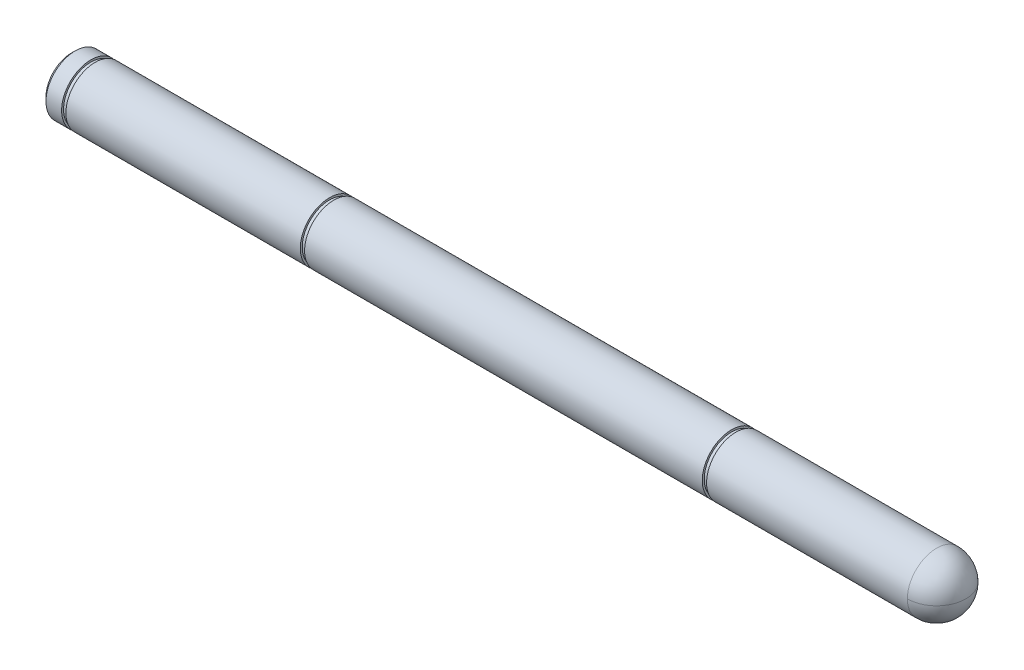
ISO-10303-21;
HEADER;
FILE_DESCRIPTION(('STEP AP214'),'2;1');
FILE_NAME('part.step','',(''),(''),'','','');
FILE_SCHEMA(('AUTOMOTIVE_DESIGN { 1 0 10303 214 1 1 1 1 }'));
ENDSEC;
DATA;
#1=APPLICATION_CONTEXT('core data for automotive mechanical design processes');
#2=APPLICATION_PROTOCOL_DEFINITION('international standard','automotive_design',2000,#1);
#3=PRODUCT_CONTEXT('',#1,'mechanical');
#4=PRODUCT('Part','Part','',(#3));
#5=PRODUCT_RELATED_PRODUCT_CATEGORY('part','',(#4));
#6=PRODUCT_DEFINITION_FORMATION('','',#4);
#7=PRODUCT_DEFINITION_CONTEXT('part definition',#1,'design');
#8=PRODUCT_DEFINITION('design','',#6,#7);
#9=PRODUCT_DEFINITION_SHAPE('','',#8);
#10=(LENGTH_UNIT() NAMED_UNIT(*) SI_UNIT(.MILLI.,.METRE.));
#11=(NAMED_UNIT(*) PLANE_ANGLE_UNIT() SI_UNIT($,.RADIAN.));
#12=(NAMED_UNIT(*) SI_UNIT($,.STERADIAN.) SOLID_ANGLE_UNIT());
#13=UNCERTAINTY_MEASURE_WITH_UNIT(LENGTH_MEASURE(1.E-05),#10,'distance_accuracy_value','');
#14=(GEOMETRIC_REPRESENTATION_CONTEXT(3) GLOBAL_UNCERTAINTY_ASSIGNED_CONTEXT((#13)) GLOBAL_UNIT_ASSIGNED_CONTEXT((#10,
#11,#12)) REPRESENTATION_CONTEXT('',''));
#15=CARTESIAN_POINT('',(0.,0.,0.));
#16=DIRECTION('',(0.,0.,1.));
#17=DIRECTION('',(1.,0.,0.));
#18=AXIS2_PLACEMENT_3D('',#15,#16,#17);
#19=CARTESIAN_POINT('',(-128.998653108,0.,0.));
#20=DIRECTION('',(1.,0.,0.));
#21=DIRECTION('',(0.,0.,-1.));
#22=AXIS2_PLACEMENT_3D('',#19,#20,#21);
#23=PLANE('',#22);
#24=CARTESIAN_POINT('',(-128.998653108,0.,-1.11022302462516E-13));
#25=DIRECTION('',(1.,0.,0.));
#26=DIRECTION('',(0.,0.,-1.));
#27=AXIS2_PLACEMENT_3D('',#24,#25,#26);
#28=CIRCLE('',#27,6.49980307283878);
#29=CARTESIAN_POINT('',(-128.998653108,0.,-6.49980307283889));
#30=VERTEX_POINT('',#29);
#31=EDGE_CURVE('E19',#30,#30,#28,.T.);
#32=ORIENTED_EDGE('',*,*,#31,.F.);
#33=EDGE_LOOP('',(#32));
#34=FACE_BOUND('',#33,.T.);
#35=ADVANCED_FACE('F16',(#34),#23,.F.);
#36=CARTESIAN_POINT('',(-127.998539496161,0.,-1.11022302462516E-13));
#37=DIRECTION('',(1.,0.,0.));
#38=DIRECTION('',(0.,0.,-1.));
#39=AXIS2_PLACEMENT_3D('',#36,#37,#38);
#40=CONICAL_SURFACE('',#39,7.49988638483501,0.785383014967778);
#41=CARTESIAN_POINT('',(-127.998425877554,0.,-1.11022302462516E-13));
#42=DIRECTION('',(1.,0.,0.));
#43=DIRECTION('',(0.,0.,-1.));
#44=AXIS2_PLACEMENT_3D('',#41,#42,#43);
#45=CIRCLE('',#44,7.5);
#46=CARTESIAN_POINT('',(-127.998425877554,0.,-7.50000000000011));
#47=VERTEX_POINT('',#46);
#48=EDGE_CURVE('E67',#47,#47,#45,.T.);
#49=ORIENTED_EDGE('',*,*,#48,.F.);
#50=EDGE_LOOP('',(#49));
#51=FACE_BOUND('',#50,.T.);
#52=ORIENTED_EDGE('',*,*,#31,.T.);
#53=EDGE_LOOP('',(#52));
#54=FACE_BOUND('',#53,.T.);
#55=ADVANCED_FACE('F74',(#51,#54),#40,.T.);
#56=CARTESIAN_POINT('',(-383.381670343,0.,0.));
#57=DIRECTION('',(1.,0.,0.));
#58=DIRECTION('',(0.,0.,-1.));
#59=AXIS2_PLACEMENT_3D('',#56,#57,#58);
#60=CYLINDRICAL_SURFACE('',#59,7.5);
#61=CARTESIAN_POINT('',(-123.998653108,2.22044604925031E-13,0.));
#62=DIRECTION('',(1.,0.,0.));
#63=DIRECTION('',(0.,0.,-1.));
#64=AXIS2_PLACEMENT_3D('',#61,#62,#63);
#65=CIRCLE('',#64,7.5);
#66=CARTESIAN_POINT('',(-123.998653108,2.22044604925031E-13,-7.5));
#67=VERTEX_POINT('',#66);
#68=EDGE_CURVE('E65',#67,#67,#65,.T.);
#69=ORIENTED_EDGE('',*,*,#68,.F.);
#70=EDGE_LOOP('',(#69));
#71=FACE_BOUND('',#70,.T.);
#72=ORIENTED_EDGE('',*,*,#48,.T.);
#73=EDGE_LOOP('',(#72));
#74=FACE_BOUND('',#73,.T.);
#75=ADVANCED_FACE('F81',(#71,#74),#60,.T.);
#76=CARTESIAN_POINT('',(-123.998653108,2.22044604925031E-13,0.));
#77=DIRECTION('',(1.,0.,0.));
#78=DIRECTION('',(0.,0.,-1.));
#79=AXIS2_PLACEMENT_3D('',#76,#77,#78);
#80=PLANE('',#79);
#81=CARTESIAN_POINT('',(-123.998653108,2.22044604925031E-13,0.));
#82=DIRECTION('',(1.,0.,0.));
#83=DIRECTION('',(0.,0.,-1.));
#84=AXIS2_PLACEMENT_3D('',#81,#82,#83);
#85=CIRCLE('',#84,7.);
#86=CARTESIAN_POINT('',(-123.998653108,2.22044604925031E-13,-7.));
#87=VERTEX_POINT('',#86);
#88=EDGE_CURVE('E47',#87,#87,#85,.T.);
#89=ORIENTED_EDGE('',*,*,#88,.F.);
#90=EDGE_LOOP('',(#89));
#91=FACE_BOUND('',#90,.T.);
#92=ORIENTED_EDGE('',*,*,#68,.T.);
#93=EDGE_LOOP('',(#92));
#94=FACE_BOUND('',#93,.T.);
#95=ADVANCED_FACE('F178',(#91,#94),#80,.T.);
#96=CARTESIAN_POINT('',(-383.381670343,0.,0.));
#97=DIRECTION('',(1.,0.,0.));
#98=DIRECTION('',(0.,0.,-1.));
#99=AXIS2_PLACEMENT_3D('',#96,#97,#98);
#100=CYLINDRICAL_SURFACE('',#99,7.);
#101=CARTESIAN_POINT('',(-122.898653108,2.22044604925031E-13,0.));
#102=DIRECTION('',(1.,0.,0.));
#103=DIRECTION('',(0.,0.,-1.));
#104=AXIS2_PLACEMENT_3D('',#101,#102,#103);
#105=CIRCLE('',#104,7.);
#106=CARTESIAN_POINT('',(-122.898653108,2.22044604925031E-13,-7.));
#107=VERTEX_POINT('',#106);
#108=EDGE_CURVE('E46',#107,#107,#105,.F.);
#109=ORIENTED_EDGE('',*,*,#108,.T.);
#110=EDGE_LOOP('',(#109));
#111=FACE_BOUND('',#110,.T.);
#112=ORIENTED_EDGE('',*,*,#88,.T.);
#113=EDGE_LOOP('',(#112));
#114=FACE_BOUND('',#113,.T.);
#115=ADVANCED_FACE('F175',(#111,#114),#100,.T.);
#116=CARTESIAN_POINT('',(92.5013468917,0.,0.));
#117=DIRECTION('',(0.,-1.,0.));
#118=DIRECTION('',(0.,0.,-1.));
#119=AXIS2_PLACEMENT_3D('',#116,#117,#118);
#120=SPHERICAL_SURFACE('',#119,7.5);
#121=CARTESIAN_POINT('',(92.5013468917,0.,0.));
#122=DIRECTION('',(1.,0.,0.));
#123=DIRECTION('',(0.,0.,-1.));
#124=AXIS2_PLACEMENT_3D('',#121,#122,#123);
#125=CIRCLE('',#124,7.5);
#126=CARTESIAN_POINT('',(92.5013468917,0.,7.50000000000001));
#127=VERTEX_POINT('',#126);
#128=CARTESIAN_POINT('',(92.5013468917,7.50000000000001,0.));
#129=VERTEX_POINT('',#128);
#130=EDGE_CURVE('E44',#127,#129,#125,.F.);
#131=ORIENTED_EDGE('',*,*,#130,.F.);
#132=CARTESIAN_POINT('',(92.5013468917,0.,0.));
#133=DIRECTION('',(0.,1.,0.));
#134=DIRECTION('',(0.,0.,1.));
#135=AXIS2_PLACEMENT_3D('',#132,#133,#134);
#136=CIRCLE('',#135,7.5);
#137=CARTESIAN_POINT('',(92.5013468917,0.,-7.50000000000001));
#138=VERTEX_POINT('',#137);
#139=EDGE_CURVE('E42',#138,#127,#136,.F.);
#140=ORIENTED_EDGE('',*,*,#139,.F.);
#141=CARTESIAN_POINT('',(92.5013468917,0.,0.));
#142=DIRECTION('',(1.,0.,0.));
#143=DIRECTION('',(0.,0.,-1.));
#144=AXIS2_PLACEMENT_3D('',#141,#142,#143);
#145=CIRCLE('',#144,7.5);
#146=EDGE_CURVE('E33',#129,#138,#145,.F.);
#147=ORIENTED_EDGE('',*,*,#146,.F.);
#148=EDGE_LOOP('',(#131,#140,#147));
#149=FACE_BOUND('',#148,.T.);
#150=ADVANCED_FACE('F43',(#149),#120,.T.);
#151=CARTESIAN_POINT('',(92.5013468917,0.,0.));
#152=DIRECTION('',(0.,1.,0.));
#153=DIRECTION('',(0.,0.,1.));
#154=AXIS2_PLACEMENT_3D('',#151,#152,#153);
#155=SPHERICAL_SURFACE('',#154,7.5);
#156=CARTESIAN_POINT('',(92.5013468917,0.,0.));
#157=DIRECTION('',(1.,0.,0.));
#158=DIRECTION('',(0.,0.,-1.));
#159=AXIS2_PLACEMENT_3D('',#156,#157,#158);
#160=CIRCLE('',#159,7.5);
#161=CARTESIAN_POINT('',(92.5013468917,-7.49999999999999,0.));
#162=VERTEX_POINT('',#161);
#163=EDGE_CURVE('E50',#138,#162,#160,.F.);
#164=ORIENTED_EDGE('',*,*,#163,.F.);
#165=ORIENTED_EDGE('',*,*,#139,.T.);
#166=CARTESIAN_POINT('',(92.5013468917,0.,0.));
#167=DIRECTION('',(1.,0.,0.));
#168=DIRECTION('',(0.,0.,-1.));
#169=AXIS2_PLACEMENT_3D('',#166,#167,#168);
#170=CIRCLE('',#169,7.5);
#171=EDGE_CURVE('E52',#162,#127,#170,.F.);
#172=ORIENTED_EDGE('',*,*,#171,.F.);
#173=EDGE_LOOP('',(#164,#165,#172));
#174=FACE_BOUND('',#173,.T.);
#175=ADVANCED_FACE('F51',(#174),#155,.T.);
#176=CARTESIAN_POINT('',(-122.898653108,2.22044604925031E-13,0.));
#177=DIRECTION('',(1.,0.,0.));
#178=DIRECTION('',(0.,0.,-1.));
#179=AXIS2_PLACEMENT_3D('',#176,#177,#178);
#180=PLANE('',#179);
#181=ORIENTED_EDGE('',*,*,#108,.F.);
#182=EDGE_LOOP('',(#181));
#183=FACE_BOUND('',#182,.T.);
#184=CARTESIAN_POINT('',(-122.898653108,2.22044604925031E-13,0.));
#185=DIRECTION('',(1.,0.,0.));
#186=DIRECTION('',(0.,0.,-1.));
#187=AXIS2_PLACEMENT_3D('',#184,#185,#186);
#188=CIRCLE('',#187,7.5);
#189=CARTESIAN_POINT('',(-122.898653108,2.22044604925031E-13,-7.5));
#190=VERTEX_POINT('',#189);
#191=EDGE_CURVE('E155',#190,#190,#188,.T.);
#192=ORIENTED_EDGE('',*,*,#191,.F.);
#193=EDGE_LOOP('',(#192));
#194=FACE_BOUND('',#193,.T.);
#195=ADVANCED_FACE('F121',(#183,#194),#180,.F.);
#196=CARTESIAN_POINT('',(-383.381670343,0.,0.));
#197=DIRECTION('',(1.,0.,0.));
#198=DIRECTION('',(0.,0.,-1.));
#199=AXIS2_PLACEMENT_3D('',#196,#197,#198);
#200=CYLINDRICAL_SURFACE('',#199,7.5);
#201=CARTESIAN_POINT('',(41.1013468917,0.,0.));
#202=DIRECTION('',(1.,0.,0.));
#203=DIRECTION('',(0.,0.,-1.));
#204=AXIS2_PLACEMENT_3D('',#201,#202,#203);
#205=CIRCLE('',#204,7.5);
#206=CARTESIAN_POINT('',(41.1013468917,0.,-7.5));
#207=VERTEX_POINT('',#206);
#208=EDGE_CURVE('E153',#207,#207,#205,.T.);
#209=ORIENTED_EDGE('',*,*,#208,.T.);
#210=EDGE_LOOP('',(#209));
#211=FACE_BOUND('',#210,.T.);
#212=ORIENTED_EDGE('',*,*,#171,.T.);
#213=ORIENTED_EDGE('',*,*,#130,.T.);
#214=ORIENTED_EDGE('',*,*,#146,.T.);
#215=ORIENTED_EDGE('',*,*,#163,.T.);
#216=EDGE_LOOP('',(#212,#213,#214,#215));
#217=FACE_BOUND('',#216,.T.);
#218=ADVANCED_FACE('F55',(#211,#217),#200,.T.);
#219=CARTESIAN_POINT('',(-383.381670343,0.,0.));
#220=DIRECTION('',(1.,0.,0.));
#221=DIRECTION('',(0.,0.,-1.));
#222=AXIS2_PLACEMENT_3D('',#219,#220,#221);
#223=CYLINDRICAL_SURFACE('',#222,7.5);
#224=ORIENTED_EDGE('',*,*,#191,.T.);
#225=EDGE_LOOP('',(#224));
#226=FACE_BOUND('',#225,.T.);
#227=CARTESIAN_POINT('',(-62.8986531083,0.,0.));
#228=DIRECTION('',(1.,0.,0.));
#229=DIRECTION('',(0.,0.,-1.));
#230=AXIS2_PLACEMENT_3D('',#227,#228,#229);
#231=CIRCLE('',#230,7.5);
#232=CARTESIAN_POINT('',(-62.8986531083,0.,-7.5));
#233=VERTEX_POINT('',#232);
#234=EDGE_CURVE('E150',#233,#233,#231,.T.);
#235=ORIENTED_EDGE('',*,*,#234,.F.);
#236=EDGE_LOOP('',(#235));
#237=FACE_BOUND('',#236,.T.);
#238=ADVANCED_FACE('F114',(#226,#237),#223,.T.);
#239=CARTESIAN_POINT('',(41.1013468917,0.,0.));
#240=DIRECTION('',(1.,0.,0.));
#241=DIRECTION('',(0.,0.,-1.));
#242=AXIS2_PLACEMENT_3D('',#239,#240,#241);
#243=PLANE('',#242);
#244=CARTESIAN_POINT('',(41.1013468917,0.,0.));
#245=DIRECTION('',(1.,0.,0.));
#246=DIRECTION('',(0.,0.,-1.));
#247=AXIS2_PLACEMENT_3D('',#244,#245,#246);
#248=CIRCLE('',#247,7.);
#249=CARTESIAN_POINT('',(41.1013468917,0.,-7.));
#250=VERTEX_POINT('',#249);
#251=EDGE_CURVE('E147',#250,#250,#248,.F.);
#252=ORIENTED_EDGE('',*,*,#251,.F.);
#253=EDGE_LOOP('',(#252));
#254=FACE_BOUND('',#253,.T.);
#255=ORIENTED_EDGE('',*,*,#208,.F.);
#256=EDGE_LOOP('',(#255));
#257=FACE_BOUND('',#256,.T.);
#258=ADVANCED_FACE('F110',(#254,#257),#243,.F.);
#259=CARTESIAN_POINT('',(-62.8986531083,0.,0.));
#260=DIRECTION('',(1.,0.,0.));
#261=DIRECTION('',(0.,0.,-1.));
#262=AXIS2_PLACEMENT_3D('',#259,#260,#261);
#263=PLANE('',#262);
#264=CARTESIAN_POINT('',(-62.8986531083,0.,0.));
#265=DIRECTION('',(1.,0.,0.));
#266=DIRECTION('',(0.,0.,-1.));
#267=AXIS2_PLACEMENT_3D('',#264,#265,#266);
#268=CIRCLE('',#267,7.);
#269=CARTESIAN_POINT('',(-62.8986531083,0.,-7.));
#270=VERTEX_POINT('',#269);
#271=EDGE_CURVE('E144',#270,#270,#268,.T.);
#272=ORIENTED_EDGE('',*,*,#271,.F.);
#273=EDGE_LOOP('',(#272));
#274=FACE_BOUND('',#273,.T.);
#275=ORIENTED_EDGE('',*,*,#234,.T.);
#276=EDGE_LOOP('',(#275));
#277=FACE_BOUND('',#276,.T.);
#278=ADVANCED_FACE('F106',(#274,#277),#263,.T.);
#279=CARTESIAN_POINT('',(-383.381670343,0.,0.));
#280=DIRECTION('',(1.,0.,0.));
#281=DIRECTION('',(0.,0.,-1.));
#282=AXIS2_PLACEMENT_3D('',#279,#280,#281);
#283=CYLINDRICAL_SURFACE('',#282,7.);
#284=ORIENTED_EDGE('',*,*,#251,.T.);
#285=EDGE_LOOP('',(#284));
#286=FACE_BOUND('',#285,.T.);
#287=CARTESIAN_POINT('',(40.0013468917,0.,0.));
#288=DIRECTION('',(1.,0.,0.));
#289=DIRECTION('',(0.,0.,-1.));
#290=AXIS2_PLACEMENT_3D('',#287,#288,#289);
#291=CIRCLE('',#290,7.);
#292=CARTESIAN_POINT('',(40.0013468917,0.,-7.));
#293=VERTEX_POINT('',#292);
#294=EDGE_CURVE('E141',#293,#293,#291,.F.);
#295=ORIENTED_EDGE('',*,*,#294,.F.);
#296=EDGE_LOOP('',(#295));
#297=FACE_BOUND('',#296,.T.);
#298=ADVANCED_FACE('F102',(#286,#297),#283,.T.);
#299=CARTESIAN_POINT('',(-383.381670343,0.,0.));
#300=DIRECTION('',(1.,0.,0.));
#301=DIRECTION('',(0.,0.,-1.));
#302=AXIS2_PLACEMENT_3D('',#299,#300,#301);
#303=CYLINDRICAL_SURFACE('',#302,7.);
#304=CARTESIAN_POINT('',(-61.7986531083,0.,0.));
#305=DIRECTION('',(1.,0.,0.));
#306=DIRECTION('',(0.,0.,-1.));
#307=AXIS2_PLACEMENT_3D('',#304,#305,#306);
#308=CIRCLE('',#307,7.);
#309=CARTESIAN_POINT('',(-61.7986531083,0.,-7.));
#310=VERTEX_POINT('',#309);
#311=EDGE_CURVE('E138',#310,#310,#308,.F.);
#312=ORIENTED_EDGE('',*,*,#311,.T.);
#313=EDGE_LOOP('',(#312));
#314=FACE_BOUND('',#313,.T.);
#315=ORIENTED_EDGE('',*,*,#271,.T.);
#316=EDGE_LOOP('',(#315));
#317=FACE_BOUND('',#316,.T.);
#318=ADVANCED_FACE('F98',(#314,#317),#303,.T.);
#319=CARTESIAN_POINT('',(40.0013468917,0.,0.));
#320=DIRECTION('',(1.,0.,0.));
#321=DIRECTION('',(0.,0.,-1.));
#322=AXIS2_PLACEMENT_3D('',#319,#320,#321);
#323=PLANE('',#322);
#324=ORIENTED_EDGE('',*,*,#294,.T.);
#325=EDGE_LOOP('',(#324));
#326=FACE_BOUND('',#325,.T.);
#327=CARTESIAN_POINT('',(40.0013468917,0.,0.));
#328=DIRECTION('',(1.,0.,0.));
#329=DIRECTION('',(0.,0.,-1.));
#330=AXIS2_PLACEMENT_3D('',#327,#328,#329);
#331=CIRCLE('',#330,7.5);
#332=CARTESIAN_POINT('',(40.0013468917,0.,-7.5));
#333=VERTEX_POINT('',#332);
#334=EDGE_CURVE('E25',#333,#333,#331,.F.);
#335=ORIENTED_EDGE('',*,*,#334,.F.);
#336=EDGE_LOOP('',(#335));
#337=FACE_BOUND('',#336,.T.);
#338=ADVANCED_FACE('F91',(#326,#337),#323,.T.);
#339=CARTESIAN_POINT('',(-61.7986531083,0.,0.));
#340=DIRECTION('',(1.,0.,0.));
#341=DIRECTION('',(0.,0.,-1.));
#342=AXIS2_PLACEMENT_3D('',#339,#340,#341);
#343=PLANE('',#342);
#344=ORIENTED_EDGE('',*,*,#311,.F.);
#345=EDGE_LOOP('',(#344));
#346=FACE_BOUND('',#345,.T.);
#347=CARTESIAN_POINT('',(-61.7986531083,0.,0.));
#348=DIRECTION('',(1.,0.,0.));
#349=DIRECTION('',(0.,0.,-1.));
#350=AXIS2_PLACEMENT_3D('',#347,#348,#349);
#351=CIRCLE('',#350,7.5);
#352=CARTESIAN_POINT('',(-61.7986531083,0.,-7.5));
#353=VERTEX_POINT('',#352);
#354=EDGE_CURVE('E11',#353,#353,#351,.T.);
#355=ORIENTED_EDGE('',*,*,#354,.F.);
#356=EDGE_LOOP('',(#355));
#357=FACE_BOUND('',#356,.T.);
#358=ADVANCED_FACE('F85',(#346,#357),#343,.F.);
#359=CARTESIAN_POINT('',(-383.381670343,0.,0.));
#360=DIRECTION('',(1.,0.,0.));
#361=DIRECTION('',(0.,0.,-1.));
#362=AXIS2_PLACEMENT_3D('',#359,#360,#361);
#363=CYLINDRICAL_SURFACE('',#362,7.5);
#364=ORIENTED_EDGE('',*,*,#354,.T.);
#365=EDGE_LOOP('',(#364));
#366=FACE_BOUND('',#365,.T.);
#367=ORIENTED_EDGE('',*,*,#334,.T.);
#368=EDGE_LOOP('',(#367));
#369=FACE_BOUND('',#368,.T.);
#370=ADVANCED_FACE('F83',(#366,#369),#363,.T.);
#371=CLOSED_SHELL('',(#35,#55,#75,#95,#115,#150,#175,#195,#218,#238,#258,#278,#298,#318,#338,
#358,#370));
#372=MANIFOLD_SOLID_BREP('B1',#371);
#373=ADVANCED_BREP_SHAPE_REPRESENTATION('',(#18,#372),#14);
#374=SHAPE_DEFINITION_REPRESENTATION(#9,#373);
ENDSEC;
END-ISO-10303-21;
